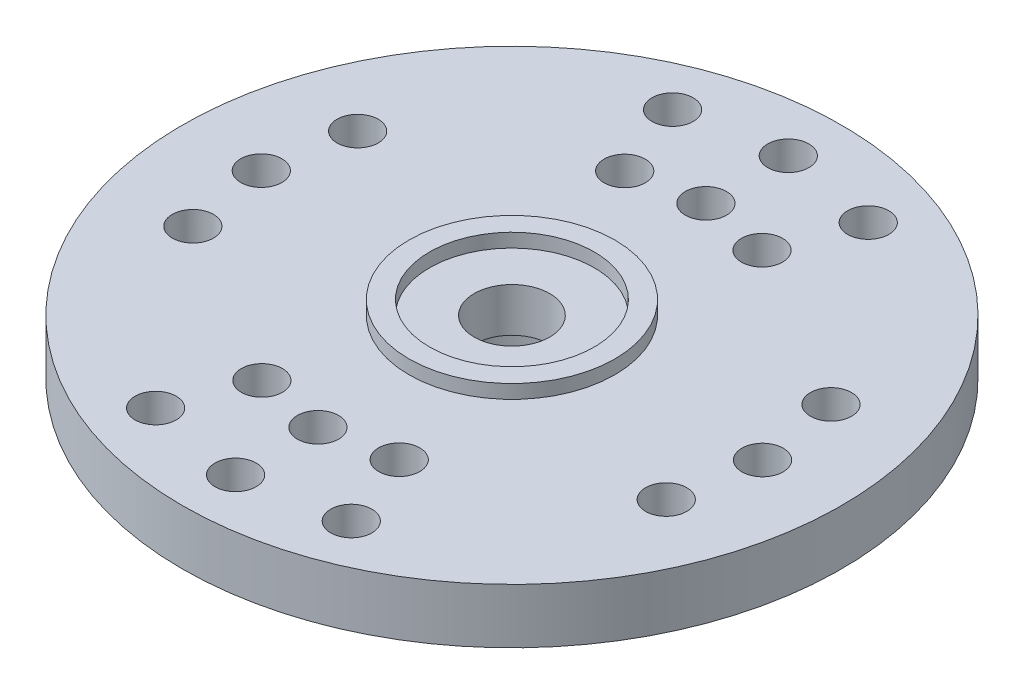
ISO-10303-21;
HEADER;
FILE_DESCRIPTION(('STEP AP214'),'2;1');
FILE_NAME('part.step','',(''),(''),'','','');
FILE_SCHEMA(('AUTOMOTIVE_DESIGN { 1 0 10303 214 1 1 1 1 }'));
ENDSEC;
DATA;
#1=APPLICATION_CONTEXT('core data for automotive mechanical design processes');
#2=APPLICATION_PROTOCOL_DEFINITION('international standard','automotive_design',2000,#1);
#3=PRODUCT_CONTEXT('',#1,'mechanical');
#4=PRODUCT('Part','Part','',(#3));
#5=PRODUCT_RELATED_PRODUCT_CATEGORY('part','',(#4));
#6=PRODUCT_DEFINITION_FORMATION('','',#4);
#7=PRODUCT_DEFINITION_CONTEXT('part definition',#1,'design');
#8=PRODUCT_DEFINITION('design','',#6,#7);
#9=PRODUCT_DEFINITION_SHAPE('','',#8);
#10=(LENGTH_UNIT() NAMED_UNIT(*) SI_UNIT(.MILLI.,.METRE.));
#11=(NAMED_UNIT(*) PLANE_ANGLE_UNIT() SI_UNIT($,.RADIAN.));
#12=(NAMED_UNIT(*) SI_UNIT($,.STERADIAN.) SOLID_ANGLE_UNIT());
#13=UNCERTAINTY_MEASURE_WITH_UNIT(LENGTH_MEASURE(1.E-05),#10,'distance_accuracy_value','');
#14=(GEOMETRIC_REPRESENTATION_CONTEXT(3) GLOBAL_UNCERTAINTY_ASSIGNED_CONTEXT((#13)) GLOBAL_UNIT_ASSIGNED_CONTEXT((#10,
#11,#12)) REPRESENTATION_CONTEXT('',''));
#15=CARTESIAN_POINT('',(0.,0.,0.));
#16=DIRECTION('',(0.,0.,1.));
#17=DIRECTION('',(1.,0.,0.));
#18=AXIS2_PLACEMENT_3D('',#15,#16,#17);
#19=CARTESIAN_POINT('',(0.,2.,0.));
#20=DIRECTION('',(0.,1.,0.));
#21=DIRECTION('',(0.,0.,1.));
#22=AXIS2_PLACEMENT_3D('',#19,#20,#21);
#23=PLANE('',#22);
#24=CARTESIAN_POINT('',(9.125,2.,0.));
#25=DIRECTION('',(0.,1.,0.));
#26=DIRECTION('',(0.,0.,1.));
#27=AXIS2_PLACEMENT_3D('',#24,#25,#26);
#28=CIRCLE('',#27,0.749999999999987);
#29=CARTESIAN_POINT('',(9.125,2.,0.749999999999987));
#30=VERTEX_POINT('',#29);
#31=EDGE_CURVE('E178',#30,#30,#28,.T.);
#32=ORIENTED_EDGE('',*,*,#31,.F.);
#33=EDGE_LOOP('',(#32));
#34=FACE_BOUND('',#33,.T.);
#35=CARTESIAN_POINT('',(-9.125,2.,0.));
#36=DIRECTION('',(0.,1.,0.));
#37=DIRECTION('',(0.,0.,1.));
#38=AXIS2_PLACEMENT_3D('',#35,#36,#37);
#39=CIRCLE('',#38,0.749999999999987);
#40=CARTESIAN_POINT('',(-9.125,2.,0.749999999999987));
#41=VERTEX_POINT('',#40);
#42=EDGE_CURVE('E172',#41,#41,#39,.T.);
#43=ORIENTED_EDGE('',*,*,#42,.F.);
#44=EDGE_LOOP('',(#43));
#45=FACE_BOUND('',#44,.T.);
#46=CARTESIAN_POINT('',(8.617750576572,2.,3.));
#47=DIRECTION('',(0.,1.,0.));
#48=DIRECTION('',(0.,0.,1.));
#49=AXIS2_PLACEMENT_3D('',#46,#47,#48);
#50=CIRCLE('',#49,0.749999999999987);
#51=CARTESIAN_POINT('',(8.617750576572,2.,3.74999999999999));
#52=VERTEX_POINT('',#51);
#53=EDGE_CURVE('E166',#52,#52,#50,.T.);
#54=ORIENTED_EDGE('',*,*,#53,.F.);
#55=EDGE_LOOP('',(#54));
#56=FACE_BOUND('',#55,.T.);
#57=CARTESIAN_POINT('',(8.617750576572,2.,-3.));
#58=DIRECTION('',(0.,1.,0.));
#59=DIRECTION('',(0.,0.,1.));
#60=AXIS2_PLACEMENT_3D('',#57,#58,#59);
#61=CIRCLE('',#60,0.749999999999987);
#62=CARTESIAN_POINT('',(8.617750576572,2.,-2.25000000000001));
#63=VERTEX_POINT('',#62);
#64=EDGE_CURVE('E160',#63,#63,#61,.T.);
#65=ORIENTED_EDGE('',*,*,#64,.F.);
#66=EDGE_LOOP('',(#65));
#67=FACE_BOUND('',#66,.T.);
#68=CARTESIAN_POINT('',(-8.617750576572,2.,3.));
#69=DIRECTION('',(0.,1.,0.));
#70=DIRECTION('',(0.,0.,1.));
#71=AXIS2_PLACEMENT_3D('',#68,#69,#70);
#72=CIRCLE('',#71,0.749999999999987);
#73=CARTESIAN_POINT('',(-8.617750576572,2.,3.74999999999999));
#74=VERTEX_POINT('',#73);
#75=EDGE_CURVE('E154',#74,#74,#72,.T.);
#76=ORIENTED_EDGE('',*,*,#75,.F.);
#77=EDGE_LOOP('',(#76));
#78=FACE_BOUND('',#77,.T.);
#79=CARTESIAN_POINT('',(-8.617750576572,2.,-3.));
#80=DIRECTION('',(0.,1.,0.));
#81=DIRECTION('',(0.,0.,1.));
#82=AXIS2_PLACEMENT_3D('',#79,#80,#81);
#83=CIRCLE('',#82,0.749999999999987);
#84=CARTESIAN_POINT('',(-8.617750576572,2.,-2.25000000000001));
#85=VERTEX_POINT('',#84);
#86=EDGE_CURVE('E148',#85,#85,#83,.T.);
#87=ORIENTED_EDGE('',*,*,#86,.F.);
#88=EDGE_LOOP('',(#87));
#89=FACE_BOUND('',#88,.T.);
#90=CARTESIAN_POINT('',(0.,2.,-7.0625));
#91=DIRECTION('',(0.,1.,0.));
#92=DIRECTION('',(0.,0.,1.));
#93=AXIS2_PLACEMENT_3D('',#90,#91,#92);
#94=CIRCLE('',#93,0.749999999999987);
#95=CARTESIAN_POINT('',(0.,2.,-6.31250000000001));
#96=VERTEX_POINT('',#95);
#97=EDGE_CURVE('E39',#96,#96,#94,.T.);
#98=ORIENTED_EDGE('',*,*,#97,.F.);
#99=EDGE_LOOP('',(#98));
#100=FACE_BOUND('',#99,.T.);
#101=CARTESIAN_POINT('',(0.,2.,7.0625));
#102=DIRECTION('',(0.,1.,0.));
#103=DIRECTION('',(0.,0.,1.));
#104=AXIS2_PLACEMENT_3D('',#101,#102,#103);
#105=CIRCLE('',#104,0.749999999999987);
#106=CARTESIAN_POINT('',(0.,2.,7.81249999999999));
#107=VERTEX_POINT('',#106);
#108=EDGE_CURVE('E139',#107,#107,#105,.T.);
#109=ORIENTED_EDGE('',*,*,#108,.F.);
#110=EDGE_LOOP('',(#109));
#111=FACE_BOUND('',#110,.T.);
#112=CARTESIAN_POINT('',(2.5,2.,-6.605218107678));
#113=DIRECTION('',(0.,1.,0.));
#114=DIRECTION('',(0.,0.,1.));
#115=AXIS2_PLACEMENT_3D('',#112,#113,#114);
#116=CIRCLE('',#115,0.749999999999987);
#117=CARTESIAN_POINT('',(2.5,2.,-5.85521810767801));
#118=VERTEX_POINT('',#117);
#119=EDGE_CURVE('E133',#118,#118,#116,.T.);
#120=ORIENTED_EDGE('',*,*,#119,.F.);
#121=EDGE_LOOP('',(#120));
#122=FACE_BOUND('',#121,.T.);
#123=CARTESIAN_POINT('',(-2.5,2.,-6.605218107678));
#124=DIRECTION('',(0.,1.,0.));
#125=DIRECTION('',(0.,0.,1.));
#126=AXIS2_PLACEMENT_3D('',#123,#124,#125);
#127=CIRCLE('',#126,0.749999999999987);
#128=CARTESIAN_POINT('',(-2.5,2.,-5.85521810767801));
#129=VERTEX_POINT('',#128);
#130=EDGE_CURVE('E127',#129,#129,#127,.T.);
#131=ORIENTED_EDGE('',*,*,#130,.F.);
#132=EDGE_LOOP('',(#131));
#133=FACE_BOUND('',#132,.T.);
#134=CARTESIAN_POINT('',(2.5,2.,6.605218107678));
#135=DIRECTION('',(0.,1.,0.));
#136=DIRECTION('',(0.,0.,1.));
#137=AXIS2_PLACEMENT_3D('',#134,#135,#136);
#138=CIRCLE('',#137,0.749999999999987);
#139=CARTESIAN_POINT('',(2.5,2.,7.35521810767799));
#140=VERTEX_POINT('',#139);
#141=EDGE_CURVE('E121',#140,#140,#138,.T.);
#142=ORIENTED_EDGE('',*,*,#141,.F.);
#143=EDGE_LOOP('',(#142));
#144=FACE_BOUND('',#143,.T.);
#145=CARTESIAN_POINT('',(-2.5,2.,6.605218107678));
#146=DIRECTION('',(0.,1.,0.));
#147=DIRECTION('',(0.,0.,1.));
#148=AXIS2_PLACEMENT_3D('',#145,#146,#147);
#149=CIRCLE('',#148,0.749999999999987);
#150=CARTESIAN_POINT('',(-2.5,2.,7.35521810767799));
#151=VERTEX_POINT('',#150);
#152=EDGE_CURVE('E115',#151,#151,#149,.T.);
#153=ORIENTED_EDGE('',*,*,#152,.F.);
#154=EDGE_LOOP('',(#153));
#155=FACE_BOUND('',#154,.T.);
#156=CARTESIAN_POINT('',(0.,2.,-10.0625));
#157=DIRECTION('',(0.,1.,0.));
#158=DIRECTION('',(0.,0.,1.));
#159=AXIS2_PLACEMENT_3D('',#156,#157,#158);
#160=CIRCLE('',#159,0.749999999999987);
#161=CARTESIAN_POINT('',(0.,2.,-9.31250000000001));
#162=VERTEX_POINT('',#161);
#163=EDGE_CURVE('E109',#162,#162,#160,.T.);
#164=ORIENTED_EDGE('',*,*,#163,.F.);
#165=EDGE_LOOP('',(#164));
#166=FACE_BOUND('',#165,.T.);
#167=CARTESIAN_POINT('',(0.,2.,10.0625));
#168=DIRECTION('',(0.,1.,0.));
#169=DIRECTION('',(0.,0.,1.));
#170=AXIS2_PLACEMENT_3D('',#167,#168,#169);
#171=CIRCLE('',#170,0.749999999999987);
#172=CARTESIAN_POINT('',(0.,2.,10.8125));
#173=VERTEX_POINT('',#172);
#174=EDGE_CURVE('E103',#173,#173,#171,.T.);
#175=ORIENTED_EDGE('',*,*,#174,.F.);
#176=EDGE_LOOP('',(#175));
#177=FACE_BOUND('',#176,.T.);
#178=CARTESIAN_POINT('',(3.561946902655,2.,-9.410974472002));
#179=DIRECTION('',(0.,1.,0.));
#180=DIRECTION('',(0.,0.,1.));
#181=AXIS2_PLACEMENT_3D('',#178,#179,#180);
#182=CIRCLE('',#181,0.749999999999987);
#183=CARTESIAN_POINT('',(3.561946902655,2.,-8.66097447200201));
#184=VERTEX_POINT('',#183);
#185=EDGE_CURVE('E97',#184,#184,#182,.T.);
#186=ORIENTED_EDGE('',*,*,#185,.F.);
#187=EDGE_LOOP('',(#186));
#188=FACE_BOUND('',#187,.T.);
#189=CARTESIAN_POINT('',(-3.561946902655,2.,-9.410974472002));
#190=DIRECTION('',(0.,1.,0.));
#191=DIRECTION('',(0.,0.,1.));
#192=AXIS2_PLACEMENT_3D('',#189,#190,#191);
#193=CIRCLE('',#192,0.749999999999987);
#194=CARTESIAN_POINT('',(-3.561946902655,2.,-8.66097447200201));
#195=VERTEX_POINT('',#194);
#196=EDGE_CURVE('E91',#195,#195,#193,.T.);
#197=ORIENTED_EDGE('',*,*,#196,.F.);
#198=EDGE_LOOP('',(#197));
#199=FACE_BOUND('',#198,.T.);
#200=CARTESIAN_POINT('',(3.561946902655,2.,9.410974472002));
#201=DIRECTION('',(0.,1.,0.));
#202=DIRECTION('',(0.,0.,1.));
#203=AXIS2_PLACEMENT_3D('',#200,#201,#202);
#204=CIRCLE('',#203,0.749999999999987);
#205=CARTESIAN_POINT('',(3.561946902655,2.,10.160974472002));
#206=VERTEX_POINT('',#205);
#207=EDGE_CURVE('E85',#206,#206,#204,.T.);
#208=ORIENTED_EDGE('',*,*,#207,.F.);
#209=EDGE_LOOP('',(#208));
#210=FACE_BOUND('',#209,.T.);
#211=CARTESIAN_POINT('',(-3.561946902655,2.,9.410974472002));
#212=DIRECTION('',(0.,1.,0.));
#213=DIRECTION('',(0.,0.,1.));
#214=AXIS2_PLACEMENT_3D('',#211,#212,#213);
#215=CIRCLE('',#214,0.749999999999987);
#216=CARTESIAN_POINT('',(-3.561946902655,2.,10.160974472002));
#217=VERTEX_POINT('',#216);
#218=EDGE_CURVE('E79',#217,#217,#215,.T.);
#219=ORIENTED_EDGE('',*,*,#218,.F.);
#220=EDGE_LOOP('',(#219));
#221=FACE_BOUND('',#220,.T.);
#222=CARTESIAN_POINT('',(0.,2.,0.));
#223=DIRECTION('',(0.,1.,0.));
#224=DIRECTION('',(0.,0.,1.));
#225=AXIS2_PLACEMENT_3D('',#222,#223,#224);
#226=CIRCLE('',#225,12.);
#227=CARTESIAN_POINT('',(0.,2.,12.));
#228=VERTEX_POINT('',#227);
#229=EDGE_CURVE('E43',#228,#228,#226,.T.);
#230=ORIENTED_EDGE('',*,*,#229,.T.);
#231=EDGE_LOOP('',(#230));
#232=FACE_BOUND('',#231,.T.);
#233=CARTESIAN_POINT('',(0.,2.,0.));
#234=DIRECTION('',(0.,1.,0.));
#235=DIRECTION('',(0.,0.,1.));
#236=AXIS2_PLACEMENT_3D('',#233,#234,#235);
#237=CIRCLE('',#236,3.75);
#238=CARTESIAN_POINT('',(0.,2.,3.75));
#239=VERTEX_POINT('',#238);
#240=EDGE_CURVE('E56',#239,#239,#237,.T.);
#241=ORIENTED_EDGE('',*,*,#240,.F.);
#242=EDGE_LOOP('',(#241));
#243=FACE_BOUND('',#242,.T.);
#244=ADVANCED_FACE('F35',(#34,#45,#56,#67,#78,#89,#100,#111,#122,#133,#144,#155,#166,#177,#188,
#199,#210,#221,#232,#243),#23,.T.);
#245=CARTESIAN_POINT('',(12.,0.,0.));
#246=DIRECTION('',(0.,-1.,0.));
#247=DIRECTION('',(0.,0.,-1.));
#248=AXIS2_PLACEMENT_3D('',#245,#246,#247);
#249=PLANE('',#248);
#250=CARTESIAN_POINT('',(9.125,0.,0.));
#251=DIRECTION('',(0.,-1.,0.));
#252=DIRECTION('',(0.,0.,-1.));
#253=AXIS2_PLACEMENT_3D('',#250,#251,#252);
#254=CIRCLE('',#253,0.749999999999987);
#255=CARTESIAN_POINT('',(9.125,0.,-0.749999999999987));
#256=VERTEX_POINT('',#255);
#257=EDGE_CURVE('E181',#256,#256,#254,.T.);
#258=ORIENTED_EDGE('',*,*,#257,.F.);
#259=EDGE_LOOP('',(#258));
#260=FACE_BOUND('',#259,.T.);
#261=CARTESIAN_POINT('',(-9.125,0.,0.));
#262=DIRECTION('',(0.,-1.,0.));
#263=DIRECTION('',(0.,0.,-1.));
#264=AXIS2_PLACEMENT_3D('',#261,#262,#263);
#265=CIRCLE('',#264,0.749999999999987);
#266=CARTESIAN_POINT('',(-9.125,0.,-0.749999999999987));
#267=VERTEX_POINT('',#266);
#268=EDGE_CURVE('E175',#267,#267,#265,.T.);
#269=ORIENTED_EDGE('',*,*,#268,.F.);
#270=EDGE_LOOP('',(#269));
#271=FACE_BOUND('',#270,.T.);
#272=CARTESIAN_POINT('',(8.617750576572,0.,3.));
#273=DIRECTION('',(0.,-1.,0.));
#274=DIRECTION('',(0.,0.,-1.));
#275=AXIS2_PLACEMENT_3D('',#272,#273,#274);
#276=CIRCLE('',#275,0.749999999999987);
#277=CARTESIAN_POINT('',(8.617750576572,0.,2.25000000000001));
#278=VERTEX_POINT('',#277);
#279=EDGE_CURVE('E169',#278,#278,#276,.T.);
#280=ORIENTED_EDGE('',*,*,#279,.F.);
#281=EDGE_LOOP('',(#280));
#282=FACE_BOUND('',#281,.T.);
#283=CARTESIAN_POINT('',(8.617750576572,0.,-3.));
#284=DIRECTION('',(0.,-1.,0.));
#285=DIRECTION('',(0.,0.,-1.));
#286=AXIS2_PLACEMENT_3D('',#283,#284,#285);
#287=CIRCLE('',#286,0.749999999999987);
#288=CARTESIAN_POINT('',(8.617750576572,0.,-3.74999999999999));
#289=VERTEX_POINT('',#288);
#290=EDGE_CURVE('E163',#289,#289,#287,.T.);
#291=ORIENTED_EDGE('',*,*,#290,.F.);
#292=EDGE_LOOP('',(#291));
#293=FACE_BOUND('',#292,.T.);
#294=CARTESIAN_POINT('',(-8.617750576572,0.,3.));
#295=DIRECTION('',(0.,-1.,0.));
#296=DIRECTION('',(0.,0.,-1.));
#297=AXIS2_PLACEMENT_3D('',#294,#295,#296);
#298=CIRCLE('',#297,0.749999999999987);
#299=CARTESIAN_POINT('',(-8.617750576572,0.,2.25000000000001));
#300=VERTEX_POINT('',#299);
#301=EDGE_CURVE('E157',#300,#300,#298,.T.);
#302=ORIENTED_EDGE('',*,*,#301,.F.);
#303=EDGE_LOOP('',(#302));
#304=FACE_BOUND('',#303,.T.);
#305=CARTESIAN_POINT('',(-8.617750576572,0.,-3.));
#306=DIRECTION('',(0.,-1.,0.));
#307=DIRECTION('',(0.,0.,-1.));
#308=AXIS2_PLACEMENT_3D('',#305,#306,#307);
#309=CIRCLE('',#308,0.749999999999987);
#310=CARTESIAN_POINT('',(-8.617750576572,0.,-3.74999999999999));
#311=VERTEX_POINT('',#310);
#312=EDGE_CURVE('E151',#311,#311,#309,.T.);
#313=ORIENTED_EDGE('',*,*,#312,.F.);
#314=EDGE_LOOP('',(#313));
#315=FACE_BOUND('',#314,.T.);
#316=CARTESIAN_POINT('',(0.,0.,-7.0625));
#317=DIRECTION('',(0.,-1.,0.));
#318=DIRECTION('',(0.,0.,-1.));
#319=AXIS2_PLACEMENT_3D('',#316,#317,#318);
#320=CIRCLE('',#319,0.749999999999987);
#321=CARTESIAN_POINT('',(0.,0.,-7.81249999999999));
#322=VERTEX_POINT('',#321);
#323=EDGE_CURVE('E145',#322,#322,#320,.T.);
#324=ORIENTED_EDGE('',*,*,#323,.F.);
#325=EDGE_LOOP('',(#324));
#326=FACE_BOUND('',#325,.T.);
#327=CARTESIAN_POINT('',(0.,0.,7.0625));
#328=DIRECTION('',(0.,-1.,0.));
#329=DIRECTION('',(0.,0.,-1.));
#330=AXIS2_PLACEMENT_3D('',#327,#328,#329);
#331=CIRCLE('',#330,0.749999999999987);
#332=CARTESIAN_POINT('',(0.,0.,6.31250000000001));
#333=VERTEX_POINT('',#332);
#334=EDGE_CURVE('E142',#333,#333,#331,.T.);
#335=ORIENTED_EDGE('',*,*,#334,.F.);
#336=EDGE_LOOP('',(#335));
#337=FACE_BOUND('',#336,.T.);
#338=CARTESIAN_POINT('',(2.5,0.,-6.605218107678));
#339=DIRECTION('',(0.,-1.,0.));
#340=DIRECTION('',(0.,0.,-1.));
#341=AXIS2_PLACEMENT_3D('',#338,#339,#340);
#342=CIRCLE('',#341,0.749999999999987);
#343=CARTESIAN_POINT('',(2.5,0.,-7.35521810767799));
#344=VERTEX_POINT('',#343);
#345=EDGE_CURVE('E136',#344,#344,#342,.T.);
#346=ORIENTED_EDGE('',*,*,#345,.F.);
#347=EDGE_LOOP('',(#346));
#348=FACE_BOUND('',#347,.T.);
#349=CARTESIAN_POINT('',(-2.5,0.,-6.605218107678));
#350=DIRECTION('',(0.,-1.,0.));
#351=DIRECTION('',(0.,0.,-1.));
#352=AXIS2_PLACEMENT_3D('',#349,#350,#351);
#353=CIRCLE('',#352,0.749999999999987);
#354=CARTESIAN_POINT('',(-2.5,0.,-7.35521810767799));
#355=VERTEX_POINT('',#354);
#356=EDGE_CURVE('E130',#355,#355,#353,.T.);
#357=ORIENTED_EDGE('',*,*,#356,.F.);
#358=EDGE_LOOP('',(#357));
#359=FACE_BOUND('',#358,.T.);
#360=CARTESIAN_POINT('',(2.5,0.,6.605218107678));
#361=DIRECTION('',(0.,-1.,0.));
#362=DIRECTION('',(0.,0.,-1.));
#363=AXIS2_PLACEMENT_3D('',#360,#361,#362);
#364=CIRCLE('',#363,0.749999999999987);
#365=CARTESIAN_POINT('',(2.5,0.,5.85521810767801));
#366=VERTEX_POINT('',#365);
#367=EDGE_CURVE('E124',#366,#366,#364,.T.);
#368=ORIENTED_EDGE('',*,*,#367,.F.);
#369=EDGE_LOOP('',(#368));
#370=FACE_BOUND('',#369,.T.);
#371=CARTESIAN_POINT('',(-2.5,0.,6.605218107678));
#372=DIRECTION('',(0.,-1.,0.));
#373=DIRECTION('',(0.,0.,-1.));
#374=AXIS2_PLACEMENT_3D('',#371,#372,#373);
#375=CIRCLE('',#374,0.749999999999987);
#376=CARTESIAN_POINT('',(-2.5,0.,5.85521810767801));
#377=VERTEX_POINT('',#376);
#378=EDGE_CURVE('E118',#377,#377,#375,.T.);
#379=ORIENTED_EDGE('',*,*,#378,.F.);
#380=EDGE_LOOP('',(#379));
#381=FACE_BOUND('',#380,.T.);
#382=CARTESIAN_POINT('',(0.,0.,-10.0625));
#383=DIRECTION('',(0.,-1.,0.));
#384=DIRECTION('',(0.,0.,-1.));
#385=AXIS2_PLACEMENT_3D('',#382,#383,#384);
#386=CIRCLE('',#385,0.749999999999987);
#387=CARTESIAN_POINT('',(0.,0.,-10.8125));
#388=VERTEX_POINT('',#387);
#389=EDGE_CURVE('E112',#388,#388,#386,.T.);
#390=ORIENTED_EDGE('',*,*,#389,.F.);
#391=EDGE_LOOP('',(#390));
#392=FACE_BOUND('',#391,.T.);
#393=CARTESIAN_POINT('',(0.,0.,10.0625));
#394=DIRECTION('',(0.,-1.,0.));
#395=DIRECTION('',(0.,0.,-1.));
#396=AXIS2_PLACEMENT_3D('',#393,#394,#395);
#397=CIRCLE('',#396,0.749999999999987);
#398=CARTESIAN_POINT('',(0.,0.,9.31250000000001));
#399=VERTEX_POINT('',#398);
#400=EDGE_CURVE('E106',#399,#399,#397,.T.);
#401=ORIENTED_EDGE('',*,*,#400,.F.);
#402=EDGE_LOOP('',(#401));
#403=FACE_BOUND('',#402,.T.);
#404=CARTESIAN_POINT('',(3.561946902655,0.,-9.410974472002));
#405=DIRECTION('',(0.,-1.,0.));
#406=DIRECTION('',(0.,0.,-1.));
#407=AXIS2_PLACEMENT_3D('',#404,#405,#406);
#408=CIRCLE('',#407,0.749999999999987);
#409=CARTESIAN_POINT('',(3.561946902655,0.,-10.160974472002));
#410=VERTEX_POINT('',#409);
#411=EDGE_CURVE('E100',#410,#410,#408,.T.);
#412=ORIENTED_EDGE('',*,*,#411,.F.);
#413=EDGE_LOOP('',(#412));
#414=FACE_BOUND('',#413,.T.);
#415=CARTESIAN_POINT('',(-3.561946902655,0.,-9.410974472002));
#416=DIRECTION('',(0.,-1.,0.));
#417=DIRECTION('',(0.,0.,-1.));
#418=AXIS2_PLACEMENT_3D('',#415,#416,#417);
#419=CIRCLE('',#418,0.749999999999987);
#420=CARTESIAN_POINT('',(-3.561946902655,0.,-10.160974472002));
#421=VERTEX_POINT('',#420);
#422=EDGE_CURVE('E94',#421,#421,#419,.T.);
#423=ORIENTED_EDGE('',*,*,#422,.F.);
#424=EDGE_LOOP('',(#423));
#425=FACE_BOUND('',#424,.T.);
#426=CARTESIAN_POINT('',(3.561946902655,0.,9.410974472002));
#427=DIRECTION('',(0.,-1.,0.));
#428=DIRECTION('',(0.,0.,-1.));
#429=AXIS2_PLACEMENT_3D('',#426,#427,#428);
#430=CIRCLE('',#429,0.749999999999987);
#431=CARTESIAN_POINT('',(3.561946902655,0.,8.66097447200201));
#432=VERTEX_POINT('',#431);
#433=EDGE_CURVE('E88',#432,#432,#430,.T.);
#434=ORIENTED_EDGE('',*,*,#433,.F.);
#435=EDGE_LOOP('',(#434));
#436=FACE_BOUND('',#435,.T.);
#437=CARTESIAN_POINT('',(-3.561946902655,0.,9.410974472002));
#438=DIRECTION('',(0.,-1.,0.));
#439=DIRECTION('',(0.,0.,-1.));
#440=AXIS2_PLACEMENT_3D('',#437,#438,#439);
#441=CIRCLE('',#440,0.749999999999987);
#442=CARTESIAN_POINT('',(-3.561946902655,0.,8.66097447200201));
#443=VERTEX_POINT('',#442);
#444=EDGE_CURVE('E82',#443,#443,#441,.T.);
#445=ORIENTED_EDGE('',*,*,#444,.F.);
#446=EDGE_LOOP('',(#445));
#447=FACE_BOUND('',#446,.T.);
#448=CARTESIAN_POINT('',(0.,0.,0.));
#449=DIRECTION('',(0.,1.,0.));
#450=DIRECTION('',(0.,0.,1.));
#451=AXIS2_PLACEMENT_3D('',#448,#449,#450);
#452=CIRCLE('',#451,12.);
#453=CARTESIAN_POINT('',(0.,0.,12.));
#454=VERTEX_POINT('',#453);
#455=EDGE_CURVE('E10',#454,#454,#452,.T.);
#456=ORIENTED_EDGE('',*,*,#455,.F.);
#457=EDGE_LOOP('',(#456));
#458=FACE_BOUND('',#457,.T.);
#459=CARTESIAN_POINT('',(0.,0.,0.));
#460=DIRECTION('',(0.,-1.,0.));
#461=DIRECTION('',(0.,0.,-1.));
#462=AXIS2_PLACEMENT_3D('',#459,#460,#461);
#463=CIRCLE('',#462,4.45);
#464=CARTESIAN_POINT('',(0.,0.,-4.45));
#465=VERTEX_POINT('',#464);
#466=EDGE_CURVE('E50',#465,#465,#463,.T.);
#467=ORIENTED_EDGE('',*,*,#466,.F.);
#468=EDGE_LOOP('',(#467));
#469=FACE_BOUND('',#468,.T.);
#470=ADVANCED_FACE('F187',(#260,#271,#282,#293,#304,#315,#326,#337,#348,#359,#370,#381,#392,
#403,#414,#425,#436,#447,#458,#469),#249,.T.);
#471=CARTESIAN_POINT('',(0.,0.,0.));
#472=DIRECTION('',(0.,1.,0.));
#473=DIRECTION('',(0.,0.,1.));
#474=AXIS2_PLACEMENT_3D('',#471,#472,#473);
#475=CYLINDRICAL_SURFACE('',#474,12.);
#476=ORIENTED_EDGE('',*,*,#455,.T.);
#477=EDGE_LOOP('',(#476));
#478=FACE_BOUND('',#477,.T.);
#479=ORIENTED_EDGE('',*,*,#229,.F.);
#480=EDGE_LOOP('',(#479));
#481=FACE_BOUND('',#480,.T.);
#482=ADVANCED_FACE('F37',(#478,#481),#475,.T.);
#483=CARTESIAN_POINT('',(0.,-2.6,0.));
#484=DIRECTION('',(0.,1.,0.));
#485=DIRECTION('',(0.,0.,1.));
#486=AXIS2_PLACEMENT_3D('',#483,#484,#485);
#487=CYLINDRICAL_SURFACE('',#486,4.45);
#488=CARTESIAN_POINT('',(0.,-2.6,0.));
#489=DIRECTION('',(0.,-1.,0.));
#490=DIRECTION('',(0.,0.,-1.));
#491=AXIS2_PLACEMENT_3D('',#488,#489,#490);
#492=CIRCLE('',#491,4.45);
#493=CARTESIAN_POINT('',(0.,-2.6,-4.45));
#494=VERTEX_POINT('',#493);
#495=EDGE_CURVE('E47',#494,#494,#492,.T.);
#496=ORIENTED_EDGE('',*,*,#495,.F.);
#497=EDGE_LOOP('',(#496));
#498=FACE_BOUND('',#497,.T.);
#499=ORIENTED_EDGE('',*,*,#466,.T.);
#500=EDGE_LOOP('',(#499));
#501=FACE_BOUND('',#500,.T.);
#502=ADVANCED_FACE('F227',(#498,#501),#487,.T.);
#503=CARTESIAN_POINT('',(0.,-2.6,0.));
#504=DIRECTION('',(0.,-1.,0.));
#505=DIRECTION('',(0.,0.,-1.));
#506=AXIS2_PLACEMENT_3D('',#503,#504,#505);
#507=PLANE('',#506);
#508=CARTESIAN_POINT('',(0.,-2.6,0.));
#509=DIRECTION('',(0.,1.,0.));
#510=DIRECTION('',(0.,0.,1.));
#511=AXIS2_PLACEMENT_3D('',#508,#509,#510);
#512=CIRCLE('',#511,2.85);
#513=CARTESIAN_POINT('',(0.,-2.6,2.85));
#514=VERTEX_POINT('',#513);
#515=EDGE_CURVE('E59',#514,#514,#512,.T.);
#516=ORIENTED_EDGE('',*,*,#515,.T.);
#517=EDGE_LOOP('',(#516));
#518=FACE_BOUND('',#517,.T.);
#519=ORIENTED_EDGE('',*,*,#495,.T.);
#520=EDGE_LOOP('',(#519));
#521=FACE_BOUND('',#520,.T.);
#522=ADVANCED_FACE('F229',(#518,#521),#507,.T.);
#523=CARTESIAN_POINT('',(0.,2.5,0.));
#524=DIRECTION('',(0.,-1.,0.));
#525=DIRECTION('',(0.,0.,-1.));
#526=AXIS2_PLACEMENT_3D('',#523,#524,#525);
#527=CYLINDRICAL_SURFACE('',#526,3.75);
#528=CARTESIAN_POINT('',(0.,2.5,0.));
#529=DIRECTION('',(0.,1.,0.));
#530=DIRECTION('',(0.,0.,1.));
#531=AXIS2_PLACEMENT_3D('',#528,#529,#530);
#532=CIRCLE('',#531,3.75);
#533=CARTESIAN_POINT('',(0.,2.5,3.75));
#534=VERTEX_POINT('',#533);
#535=EDGE_CURVE('E53',#534,#534,#532,.T.);
#536=ORIENTED_EDGE('',*,*,#535,.F.);
#537=EDGE_LOOP('',(#536));
#538=FACE_BOUND('',#537,.T.);
#539=ORIENTED_EDGE('',*,*,#240,.T.);
#540=EDGE_LOOP('',(#539));
#541=FACE_BOUND('',#540,.T.);
#542=ADVANCED_FACE('F236',(#538,#541),#527,.T.);
#543=CARTESIAN_POINT('',(0.,2.5,0.));
#544=DIRECTION('',(0.,1.,0.));
#545=DIRECTION('',(0.,0.,1.));
#546=AXIS2_PLACEMENT_3D('',#543,#544,#545);
#547=PLANE('',#546);
#548=CARTESIAN_POINT('',(0.,2.5,0.));
#549=DIRECTION('',(0.,1.,0.));
#550=DIRECTION('',(0.,0.,1.));
#551=AXIS2_PLACEMENT_3D('',#548,#549,#550);
#552=CIRCLE('',#551,3.);
#553=CARTESIAN_POINT('',(0.,2.5,3.));
#554=VERTEX_POINT('',#553);
#555=EDGE_CURVE('E64',#554,#554,#552,.T.);
#556=ORIENTED_EDGE('',*,*,#555,.F.);
#557=EDGE_LOOP('',(#556));
#558=FACE_BOUND('',#557,.T.);
#559=ORIENTED_EDGE('',*,*,#535,.T.);
#560=EDGE_LOOP('',(#559));
#561=FACE_BOUND('',#560,.T.);
#562=ADVANCED_FACE('F287',(#558,#561),#547,.T.);
#563=CARTESIAN_POINT('',(0.,-2.6,0.));
#564=DIRECTION('',(0.,1.,0.));
#565=DIRECTION('',(0.,0.,1.));
#566=AXIS2_PLACEMENT_3D('',#563,#564,#565);
#567=CYLINDRICAL_SURFACE('',#566,2.85);
#568=ORIENTED_EDGE('',*,*,#515,.F.);
#569=EDGE_LOOP('',(#568));
#570=FACE_BOUND('',#569,.T.);
#571=CARTESIAN_POINT('',(0.,0.4,0.));
#572=DIRECTION('',(0.,1.,0.));
#573=DIRECTION('',(0.,0.,1.));
#574=AXIS2_PLACEMENT_3D('',#571,#572,#573);
#575=CIRCLE('',#574,2.85);
#576=CARTESIAN_POINT('',(0.,0.4,2.85));
#577=VERTEX_POINT('',#576);
#578=EDGE_CURVE('E76',#577,#577,#575,.T.);
#579=ORIENTED_EDGE('',*,*,#578,.T.);
#580=EDGE_LOOP('',(#579));
#581=FACE_BOUND('',#580,.T.);
#582=ADVANCED_FACE('F293',(#570,#581),#567,.F.);
#583=CARTESIAN_POINT('',(0.,-2.6,0.));
#584=DIRECTION('',(0.,1.,0.));
#585=DIRECTION('',(0.,0.,1.));
#586=AXIS2_PLACEMENT_3D('',#583,#584,#585);
#587=CYLINDRICAL_SURFACE('',#586,3.);
#588=CARTESIAN_POINT('',(0.,2.,0.));
#589=DIRECTION('',(0.,1.,0.));
#590=DIRECTION('',(0.,0.,1.));
#591=AXIS2_PLACEMENT_3D('',#588,#589,#590);
#592=CIRCLE('',#591,3.);
#593=CARTESIAN_POINT('',(0.,2.,3.));
#594=VERTEX_POINT('',#593);
#595=EDGE_CURVE('E67',#594,#594,#592,.T.);
#596=ORIENTED_EDGE('',*,*,#595,.F.);
#597=EDGE_LOOP('',(#596));
#598=FACE_BOUND('',#597,.T.);
#599=ORIENTED_EDGE('',*,*,#555,.T.);
#600=EDGE_LOOP('',(#599));
#601=FACE_BOUND('',#600,.T.);
#602=ADVANCED_FACE('F300',(#598,#601),#587,.F.);
#603=CARTESIAN_POINT('',(3.,2.,0.));
#604=DIRECTION('',(0.,-1.,0.));
#605=DIRECTION('',(0.,0.,-1.));
#606=AXIS2_PLACEMENT_3D('',#603,#604,#605);
#607=PLANE('',#606);
#608=CARTESIAN_POINT('',(0.,2.,0.));
#609=DIRECTION('',(0.,1.,0.));
#610=DIRECTION('',(0.,0.,1.));
#611=AXIS2_PLACEMENT_3D('',#608,#609,#610);
#612=CIRCLE('',#611,1.375);
#613=CARTESIAN_POINT('',(0.,2.,1.375));
#614=VERTEX_POINT('',#613);
#615=EDGE_CURVE('E70',#614,#614,#612,.T.);
#616=ORIENTED_EDGE('',*,*,#615,.F.);
#617=EDGE_LOOP('',(#616));
#618=FACE_BOUND('',#617,.T.);
#619=ORIENTED_EDGE('',*,*,#595,.T.);
#620=EDGE_LOOP('',(#619));
#621=FACE_BOUND('',#620,.T.);
#622=ADVANCED_FACE('F304',(#618,#621),#607,.F.);
#623=CARTESIAN_POINT('',(0.,-2.6,0.));
#624=DIRECTION('',(0.,1.,0.));
#625=DIRECTION('',(0.,0.,1.));
#626=AXIS2_PLACEMENT_3D('',#623,#624,#625);
#627=CYLINDRICAL_SURFACE('',#626,1.375);
#628=CARTESIAN_POINT('',(0.,0.4,0.));
#629=DIRECTION('',(0.,1.,0.));
#630=DIRECTION('',(0.,0.,1.));
#631=AXIS2_PLACEMENT_3D('',#628,#629,#630);
#632=CIRCLE('',#631,1.375);
#633=CARTESIAN_POINT('',(0.,0.4,1.375));
#634=VERTEX_POINT('',#633);
#635=EDGE_CURVE('E73',#634,#634,#632,.T.);
#636=ORIENTED_EDGE('',*,*,#635,.F.);
#637=EDGE_LOOP('',(#636));
#638=FACE_BOUND('',#637,.T.);
#639=ORIENTED_EDGE('',*,*,#615,.T.);
#640=EDGE_LOOP('',(#639));
#641=FACE_BOUND('',#640,.T.);
#642=ADVANCED_FACE('F308',(#638,#641),#627,.F.);
#643=CARTESIAN_POINT('',(1.375,0.4,0.));
#644=DIRECTION('',(0.,1.,0.));
#645=DIRECTION('',(0.,0.,1.));
#646=AXIS2_PLACEMENT_3D('',#643,#644,#645);
#647=PLANE('',#646);
#648=ORIENTED_EDGE('',*,*,#578,.F.);
#649=EDGE_LOOP('',(#648));
#650=FACE_BOUND('',#649,.T.);
#651=ORIENTED_EDGE('',*,*,#635,.T.);
#652=EDGE_LOOP('',(#651));
#653=FACE_BOUND('',#652,.T.);
#654=ADVANCED_FACE('F312',(#650,#653),#647,.F.);
#655=CARTESIAN_POINT('',(-3.561946902655,0.,9.410974472002));
#656=DIRECTION('',(0.,-1.,0.));
#657=DIRECTION('',(0.,0.,-1.));
#658=AXIS2_PLACEMENT_3D('',#655,#656,#657);
#659=CYLINDRICAL_SURFACE('',#658,0.749999999999987);
#660=ORIENTED_EDGE('',*,*,#218,.T.);
#661=EDGE_LOOP('',(#660));
#662=FACE_BOUND('',#661,.T.);
#663=ORIENTED_EDGE('',*,*,#444,.T.);
#664=EDGE_LOOP('',(#663));
#665=FACE_BOUND('',#664,.T.);
#666=ADVANCED_FACE('F316',(#662,#665),#659,.F.);
#667=CARTESIAN_POINT('',(3.561946902655,0.,9.410974472002));
#668=DIRECTION('',(0.,-1.,0.));
#669=DIRECTION('',(0.,0.,-1.));
#670=AXIS2_PLACEMENT_3D('',#667,#668,#669);
#671=CYLINDRICAL_SURFACE('',#670,0.749999999999987);
#672=ORIENTED_EDGE('',*,*,#207,.T.);
#673=EDGE_LOOP('',(#672));
#674=FACE_BOUND('',#673,.T.);
#675=ORIENTED_EDGE('',*,*,#433,.T.);
#676=EDGE_LOOP('',(#675));
#677=FACE_BOUND('',#676,.T.);
#678=ADVANCED_FACE('F320',(#674,#677),#671,.F.);
#679=CARTESIAN_POINT('',(-3.561946902655,0.,-9.410974472002));
#680=DIRECTION('',(0.,-1.,0.));
#681=DIRECTION('',(0.,0.,-1.));
#682=AXIS2_PLACEMENT_3D('',#679,#680,#681);
#683=CYLINDRICAL_SURFACE('',#682,0.749999999999987);
#684=ORIENTED_EDGE('',*,*,#196,.T.);
#685=EDGE_LOOP('',(#684));
#686=FACE_BOUND('',#685,.T.);
#687=ORIENTED_EDGE('',*,*,#422,.T.);
#688=EDGE_LOOP('',(#687));
#689=FACE_BOUND('',#688,.T.);
#690=ADVANCED_FACE('F324',(#686,#689),#683,.F.);
#691=CARTESIAN_POINT('',(3.561946902655,0.,-9.410974472002));
#692=DIRECTION('',(0.,-1.,0.));
#693=DIRECTION('',(0.,0.,-1.));
#694=AXIS2_PLACEMENT_3D('',#691,#692,#693);
#695=CYLINDRICAL_SURFACE('',#694,0.749999999999987);
#696=ORIENTED_EDGE('',*,*,#185,.T.);
#697=EDGE_LOOP('',(#696));
#698=FACE_BOUND('',#697,.T.);
#699=ORIENTED_EDGE('',*,*,#411,.T.);
#700=EDGE_LOOP('',(#699));
#701=FACE_BOUND('',#700,.T.);
#702=ADVANCED_FACE('F328',(#698,#701),#695,.F.);
#703=CARTESIAN_POINT('',(0.,0.,10.0625));
#704=DIRECTION('',(0.,-1.,0.));
#705=DIRECTION('',(0.,0.,-1.));
#706=AXIS2_PLACEMENT_3D('',#703,#704,#705);
#707=CYLINDRICAL_SURFACE('',#706,0.749999999999987);
#708=ORIENTED_EDGE('',*,*,#174,.T.);
#709=EDGE_LOOP('',(#708));
#710=FACE_BOUND('',#709,.T.);
#711=ORIENTED_EDGE('',*,*,#400,.T.);
#712=EDGE_LOOP('',(#711));
#713=FACE_BOUND('',#712,.T.);
#714=ADVANCED_FACE('F332',(#710,#713),#707,.F.);
#715=CARTESIAN_POINT('',(0.,0.,-10.0625));
#716=DIRECTION('',(0.,-1.,0.));
#717=DIRECTION('',(0.,0.,-1.));
#718=AXIS2_PLACEMENT_3D('',#715,#716,#717);
#719=CYLINDRICAL_SURFACE('',#718,0.749999999999987);
#720=ORIENTED_EDGE('',*,*,#163,.T.);
#721=EDGE_LOOP('',(#720));
#722=FACE_BOUND('',#721,.T.);
#723=ORIENTED_EDGE('',*,*,#389,.T.);
#724=EDGE_LOOP('',(#723));
#725=FACE_BOUND('',#724,.T.);
#726=ADVANCED_FACE('F336',(#722,#725),#719,.F.);
#727=CARTESIAN_POINT('',(-2.5,0.,6.605218107678));
#728=DIRECTION('',(0.,-1.,0.));
#729=DIRECTION('',(0.,0.,-1.));
#730=AXIS2_PLACEMENT_3D('',#727,#728,#729);
#731=CYLINDRICAL_SURFACE('',#730,0.749999999999987);
#732=ORIENTED_EDGE('',*,*,#152,.T.);
#733=EDGE_LOOP('',(#732));
#734=FACE_BOUND('',#733,.T.);
#735=ORIENTED_EDGE('',*,*,#378,.T.);
#736=EDGE_LOOP('',(#735));
#737=FACE_BOUND('',#736,.T.);
#738=ADVANCED_FACE('F340',(#734,#737),#731,.F.);
#739=CARTESIAN_POINT('',(2.5,0.,6.605218107678));
#740=DIRECTION('',(0.,-1.,0.));
#741=DIRECTION('',(0.,0.,-1.));
#742=AXIS2_PLACEMENT_3D('',#739,#740,#741);
#743=CYLINDRICAL_SURFACE('',#742,0.749999999999987);
#744=ORIENTED_EDGE('',*,*,#141,.T.);
#745=EDGE_LOOP('',(#744));
#746=FACE_BOUND('',#745,.T.);
#747=ORIENTED_EDGE('',*,*,#367,.T.);
#748=EDGE_LOOP('',(#747));
#749=FACE_BOUND('',#748,.T.);
#750=ADVANCED_FACE('F344',(#746,#749),#743,.F.);
#751=CARTESIAN_POINT('',(-2.5,0.,-6.605218107678));
#752=DIRECTION('',(0.,-1.,0.));
#753=DIRECTION('',(0.,0.,-1.));
#754=AXIS2_PLACEMENT_3D('',#751,#752,#753);
#755=CYLINDRICAL_SURFACE('',#754,0.749999999999987);
#756=ORIENTED_EDGE('',*,*,#130,.T.);
#757=EDGE_LOOP('',(#756));
#758=FACE_BOUND('',#757,.T.);
#759=ORIENTED_EDGE('',*,*,#356,.T.);
#760=EDGE_LOOP('',(#759));
#761=FACE_BOUND('',#760,.T.);
#762=ADVANCED_FACE('F348',(#758,#761),#755,.F.);
#763=CARTESIAN_POINT('',(2.5,0.,-6.605218107678));
#764=DIRECTION('',(0.,-1.,0.));
#765=DIRECTION('',(0.,0.,-1.));
#766=AXIS2_PLACEMENT_3D('',#763,#764,#765);
#767=CYLINDRICAL_SURFACE('',#766,0.749999999999987);
#768=ORIENTED_EDGE('',*,*,#119,.T.);
#769=EDGE_LOOP('',(#768));
#770=FACE_BOUND('',#769,.T.);
#771=ORIENTED_EDGE('',*,*,#345,.T.);
#772=EDGE_LOOP('',(#771));
#773=FACE_BOUND('',#772,.T.);
#774=ADVANCED_FACE('F352',(#770,#773),#767,.F.);
#775=CARTESIAN_POINT('',(0.,0.,7.0625));
#776=DIRECTION('',(0.,-1.,0.));
#777=DIRECTION('',(0.,0.,-1.));
#778=AXIS2_PLACEMENT_3D('',#775,#776,#777);
#779=CYLINDRICAL_SURFACE('',#778,0.749999999999987);
#780=ORIENTED_EDGE('',*,*,#108,.T.);
#781=EDGE_LOOP('',(#780));
#782=FACE_BOUND('',#781,.T.);
#783=ORIENTED_EDGE('',*,*,#334,.T.);
#784=EDGE_LOOP('',(#783));
#785=FACE_BOUND('',#784,.T.);
#786=ADVANCED_FACE('F356',(#782,#785),#779,.F.);
#787=CARTESIAN_POINT('',(0.,0.,-7.0625));
#788=DIRECTION('',(0.,-1.,0.));
#789=DIRECTION('',(0.,0.,-1.));
#790=AXIS2_PLACEMENT_3D('',#787,#788,#789);
#791=CYLINDRICAL_SURFACE('',#790,0.749999999999987);
#792=ORIENTED_EDGE('',*,*,#97,.T.);
#793=EDGE_LOOP('',(#792));
#794=FACE_BOUND('',#793,.T.);
#795=ORIENTED_EDGE('',*,*,#323,.T.);
#796=EDGE_LOOP('',(#795));
#797=FACE_BOUND('',#796,.T.);
#798=ADVANCED_FACE('F360',(#794,#797),#791,.F.);
#799=CARTESIAN_POINT('',(-8.617750576572,0.,-3.));
#800=DIRECTION('',(0.,-1.,0.));
#801=DIRECTION('',(0.,0.,-1.));
#802=AXIS2_PLACEMENT_3D('',#799,#800,#801);
#803=CYLINDRICAL_SURFACE('',#802,0.749999999999987);
#804=ORIENTED_EDGE('',*,*,#86,.T.);
#805=EDGE_LOOP('',(#804));
#806=FACE_BOUND('',#805,.T.);
#807=ORIENTED_EDGE('',*,*,#312,.T.);
#808=EDGE_LOOP('',(#807));
#809=FACE_BOUND('',#808,.T.);
#810=ADVANCED_FACE('F364',(#806,#809),#803,.F.);
#811=CARTESIAN_POINT('',(-8.617750576572,0.,3.));
#812=DIRECTION('',(0.,-1.,0.));
#813=DIRECTION('',(0.,0.,-1.));
#814=AXIS2_PLACEMENT_3D('',#811,#812,#813);
#815=CYLINDRICAL_SURFACE('',#814,0.749999999999987);
#816=ORIENTED_EDGE('',*,*,#75,.T.);
#817=EDGE_LOOP('',(#816));
#818=FACE_BOUND('',#817,.T.);
#819=ORIENTED_EDGE('',*,*,#301,.T.);
#820=EDGE_LOOP('',(#819));
#821=FACE_BOUND('',#820,.T.);
#822=ADVANCED_FACE('F368',(#818,#821),#815,.F.);
#823=CARTESIAN_POINT('',(8.617750576572,0.,-3.));
#824=DIRECTION('',(0.,-1.,0.));
#825=DIRECTION('',(0.,0.,-1.));
#826=AXIS2_PLACEMENT_3D('',#823,#824,#825);
#827=CYLINDRICAL_SURFACE('',#826,0.749999999999987);
#828=ORIENTED_EDGE('',*,*,#64,.T.);
#829=EDGE_LOOP('',(#828));
#830=FACE_BOUND('',#829,.T.);
#831=ORIENTED_EDGE('',*,*,#290,.T.);
#832=EDGE_LOOP('',(#831));
#833=FACE_BOUND('',#832,.T.);
#834=ADVANCED_FACE('F372',(#830,#833),#827,.F.);
#835=CARTESIAN_POINT('',(8.617750576572,0.,3.));
#836=DIRECTION('',(0.,-1.,0.));
#837=DIRECTION('',(0.,0.,-1.));
#838=AXIS2_PLACEMENT_3D('',#835,#836,#837);
#839=CYLINDRICAL_SURFACE('',#838,0.749999999999987);
#840=ORIENTED_EDGE('',*,*,#53,.T.);
#841=EDGE_LOOP('',(#840));
#842=FACE_BOUND('',#841,.T.);
#843=ORIENTED_EDGE('',*,*,#279,.T.);
#844=EDGE_LOOP('',(#843));
#845=FACE_BOUND('',#844,.T.);
#846=ADVANCED_FACE('F376',(#842,#845),#839,.F.);
#847=CARTESIAN_POINT('',(-9.125,0.,0.));
#848=DIRECTION('',(0.,-1.,0.));
#849=DIRECTION('',(0.,0.,-1.));
#850=AXIS2_PLACEMENT_3D('',#847,#848,#849);
#851=CYLINDRICAL_SURFACE('',#850,0.749999999999987);
#852=ORIENTED_EDGE('',*,*,#42,.T.);
#853=EDGE_LOOP('',(#852));
#854=FACE_BOUND('',#853,.T.);
#855=ORIENTED_EDGE('',*,*,#268,.T.);
#856=EDGE_LOOP('',(#855));
#857=FACE_BOUND('',#856,.T.);
#858=ADVANCED_FACE('F380',(#854,#857),#851,.F.);
#859=CARTESIAN_POINT('',(9.125,0.,0.));
#860=DIRECTION('',(0.,-1.,0.));
#861=DIRECTION('',(0.,0.,-1.));
#862=AXIS2_PLACEMENT_3D('',#859,#860,#861);
#863=CYLINDRICAL_SURFACE('',#862,0.749999999999987);
#864=ORIENTED_EDGE('',*,*,#31,.T.);
#865=EDGE_LOOP('',(#864));
#866=FACE_BOUND('',#865,.T.);
#867=ORIENTED_EDGE('',*,*,#257,.T.);
#868=EDGE_LOOP('',(#867));
#869=FACE_BOUND('',#868,.T.);
#870=ADVANCED_FACE('F185',(#866,#869),#863,.F.);
#871=CLOSED_SHELL('',(#244,#470,#482,#502,#522,#542,#562,#582,#602,#622,#642,#654,#666,#678,
#690,#702,#714,#726,#738,#750,#762,#774,#786,#798,#810,#822,#834,#846,#858,#870));
#872=MANIFOLD_SOLID_BREP('B2',#871);
#873=ADVANCED_BREP_SHAPE_REPRESENTATION('',(#18,#872),#14);
#874=SHAPE_DEFINITION_REPRESENTATION(#9,#873);
ENDSEC;
END-ISO-10303-21;
